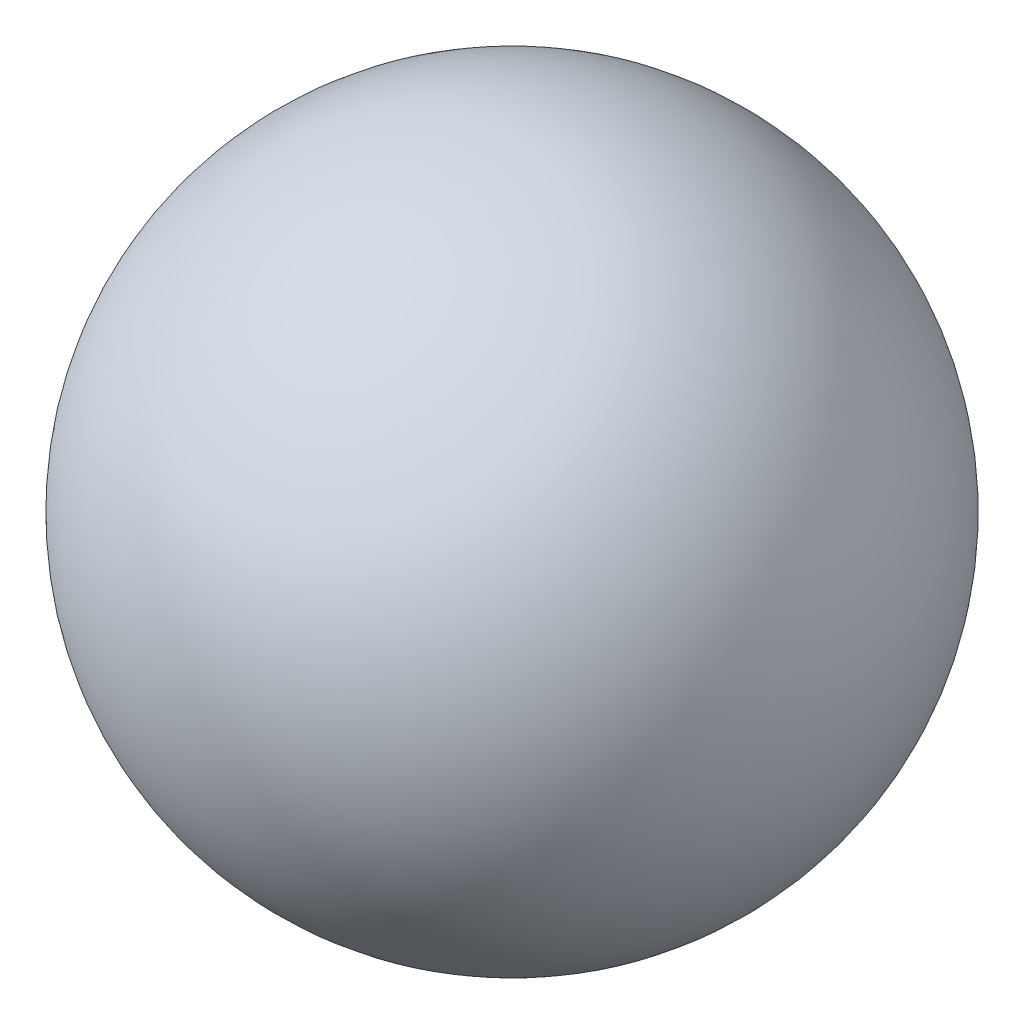
ISO-10303-21;
HEADER;
FILE_DESCRIPTION(('STEP AP214'),'2;1');
FILE_NAME('part.step','',(''),(''),'','','');
FILE_SCHEMA(('AUTOMOTIVE_DESIGN { 1 0 10303 214 1 1 1 1 }'));
ENDSEC;
DATA;
#1=APPLICATION_CONTEXT('core data for automotive mechanical design processes');
#2=APPLICATION_PROTOCOL_DEFINITION('international standard','automotive_design',2000,#1);
#3=PRODUCT_CONTEXT('',#1,'mechanical');
#4=PRODUCT('Part','Part','',(#3));
#5=PRODUCT_RELATED_PRODUCT_CATEGORY('part','',(#4));
#6=PRODUCT_DEFINITION_FORMATION('','',#4);
#7=PRODUCT_DEFINITION_CONTEXT('part definition',#1,'design');
#8=PRODUCT_DEFINITION('design','',#6,#7);
#9=PRODUCT_DEFINITION_SHAPE('','',#8);
#10=(LENGTH_UNIT() NAMED_UNIT(*) SI_UNIT(.MILLI.,.METRE.));
#11=(NAMED_UNIT(*) PLANE_ANGLE_UNIT() SI_UNIT($,.RADIAN.));
#12=(NAMED_UNIT(*) SI_UNIT($,.STERADIAN.) SOLID_ANGLE_UNIT());
#13=UNCERTAINTY_MEASURE_WITH_UNIT(LENGTH_MEASURE(1.E-05),#10,'distance_accuracy_value','');
#14=(GEOMETRIC_REPRESENTATION_CONTEXT(3) GLOBAL_UNCERTAINTY_ASSIGNED_CONTEXT((#13)) GLOBAL_UNIT_ASSIGNED_CONTEXT((#10,
#11,#12)) REPRESENTATION_CONTEXT('',''));
#15=CARTESIAN_POINT('',(0.,0.,0.));
#16=DIRECTION('',(0.,0.,1.));
#17=DIRECTION('',(1.,0.,0.));
#18=AXIS2_PLACEMENT_3D('',#15,#16,#17);
#19=CARTESIAN_POINT('',(0.,0.,0.));
#20=DIRECTION('',(0.,1.,0.));
#21=DIRECTION('',(1.,0.,0.));
#22=AXIS2_PLACEMENT_3D('',#19,#20,#21);
#23=SPHERICAL_SURFACE('',#22,6.35);
#24=CARTESIAN_POINT('',(0.,6.35,0.));
#25=VERTEX_POINT('',#24);
#26=VERTEX_LOOP('',#25);
#27=FACE_BOUND('',#26,.T.);
#28=ADVANCED_FACE('F30',(#27),#23,.T.);
#29=CLOSED_SHELL('',(#28));
#30=MANIFOLD_SOLID_BREP('B2',#29);
#31=ADVANCED_BREP_SHAPE_REPRESENTATION('',(#18,#30),#14);
#32=SHAPE_DEFINITION_REPRESENTATION(#9,#31);
ENDSEC;
END-ISO-10303-21;
